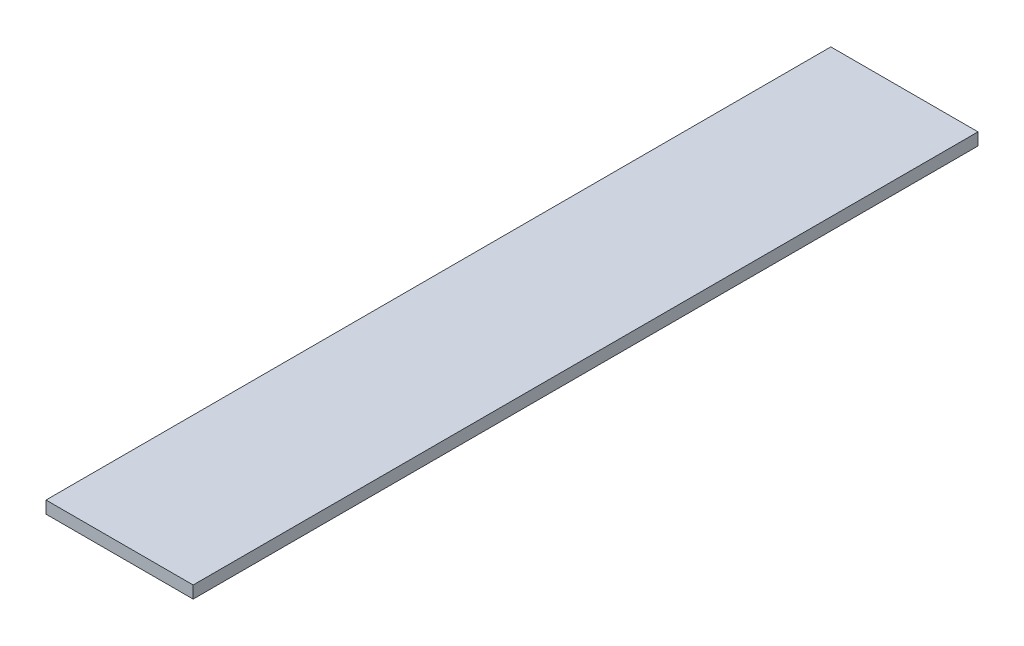
ISO-10303-21;
HEADER;
FILE_DESCRIPTION(('STEP AP214'),'2;1');
FILE_NAME('part.step','',(''),(''),'','','');
FILE_SCHEMA(('AUTOMOTIVE_DESIGN { 1 0 10303 214 1 1 1 1 }'));
ENDSEC;
DATA;
#1=APPLICATION_CONTEXT('core data for automotive mechanical design processes');
#2=APPLICATION_PROTOCOL_DEFINITION('international standard','automotive_design',2000,#1);
#3=PRODUCT_CONTEXT('',#1,'mechanical');
#4=PRODUCT('Part','Part','',(#3));
#5=PRODUCT_RELATED_PRODUCT_CATEGORY('part','',(#4));
#6=PRODUCT_DEFINITION_FORMATION('','',#4);
#7=PRODUCT_DEFINITION_CONTEXT('part definition',#1,'design');
#8=PRODUCT_DEFINITION('design','',#6,#7);
#9=PRODUCT_DEFINITION_SHAPE('','',#8);
#10=(LENGTH_UNIT() NAMED_UNIT(*) SI_UNIT(.MILLI.,.METRE.));
#11=(NAMED_UNIT(*) PLANE_ANGLE_UNIT() SI_UNIT($,.RADIAN.));
#12=(NAMED_UNIT(*) SI_UNIT($,.STERADIAN.) SOLID_ANGLE_UNIT());
#13=UNCERTAINTY_MEASURE_WITH_UNIT(LENGTH_MEASURE(1.E-05),#10,'distance_accuracy_value','');
#14=(GEOMETRIC_REPRESENTATION_CONTEXT(3) GLOBAL_UNCERTAINTY_ASSIGNED_CONTEXT((#13)) GLOBAL_UNIT_ASSIGNED_CONTEXT((#10,
#11,#12)) REPRESENTATION_CONTEXT('',''));
#15=CARTESIAN_POINT('',(0.,0.,0.));
#16=DIRECTION('',(0.,0.,1.));
#17=DIRECTION('',(1.,0.,0.));
#18=AXIS2_PLACEMENT_3D('',#15,#16,#17);
#19=CARTESIAN_POINT('',(9.525,-0.79375,101.6));
#20=DIRECTION('',(-1.,0.,0.));
#21=DIRECTION('',(0.,0.,1.));
#22=AXIS2_PLACEMENT_3D('',#19,#20,#21);
#23=PLANE('',#22);
#24=DIRECTION('',(0.,1.,0.));
#25=VECTOR('',#24,1.);
#26=CARTESIAN_POINT('',(9.525,-0.79375,0.));
#27=LINE('',#26,#25);
#28=CARTESIAN_POINT('',(9.525,-0.79375,0.));
#29=VERTEX_POINT('',#28);
#30=CARTESIAN_POINT('',(9.525,0.79375,0.));
#31=VERTEX_POINT('',#30);
#32=EDGE_CURVE('E107',#29,#31,#27,.T.);
#33=ORIENTED_EDGE('',*,*,#32,.T.);
#34=DIRECTION('',(0.,0.,-1.));
#35=VECTOR('',#34,1.);
#36=CARTESIAN_POINT('',(9.525,0.79375,101.6));
#37=LINE('',#36,#35);
#38=CARTESIAN_POINT('',(9.525,0.79375,101.6));
#39=VERTEX_POINT('',#38);
#40=EDGE_CURVE('E11',#39,#31,#37,.T.);
#41=ORIENTED_EDGE('',*,*,#40,.F.);
#42=DIRECTION('',(0.,1.,0.));
#43=VECTOR('',#42,1.);
#44=CARTESIAN_POINT('',(9.525,-0.79375,101.6));
#45=LINE('',#44,#43);
#46=CARTESIAN_POINT('',(9.525,-0.79375,101.6));
#47=VERTEX_POINT('',#46);
#48=EDGE_CURVE('E91',#47,#39,#45,.T.);
#49=ORIENTED_EDGE('',*,*,#48,.F.);
#50=DIRECTION('',(0.,0.,-1.));
#51=VECTOR('',#50,1.);
#52=CARTESIAN_POINT('',(9.525,-0.79375,101.6));
#53=LINE('',#52,#51);
#54=EDGE_CURVE('E103',#47,#29,#53,.T.);
#55=ORIENTED_EDGE('',*,*,#54,.T.);
#56=EDGE_LOOP('',(#33,#41,#49,#55));
#57=FACE_BOUND('',#56,.T.);
#58=ADVANCED_FACE('F39',(#57),#23,.F.);
#59=CARTESIAN_POINT('',(-9.525,0.79375,101.6));
#60=DIRECTION('',(0.,-1.,0.));
#61=DIRECTION('',(0.,0.,-1.));
#62=AXIS2_PLACEMENT_3D('',#59,#60,#61);
#63=PLANE('',#62);
#64=DIRECTION('',(-1.,0.,0.));
#65=VECTOR('',#64,1.);
#66=CARTESIAN_POINT('',(-9.525,0.79375,0.));
#67=LINE('',#66,#65);
#68=CARTESIAN_POINT('',(-9.525,0.79375,0.));
#69=VERTEX_POINT('',#68);
#70=EDGE_CURVE('E96',#31,#69,#67,.T.);
#71=ORIENTED_EDGE('',*,*,#70,.T.);
#72=DIRECTION('',(0.,0.,-1.));
#73=VECTOR('',#72,1.);
#74=CARTESIAN_POINT('',(-9.525,0.79375,101.6));
#75=LINE('',#74,#73);
#76=CARTESIAN_POINT('',(-9.525,0.79375,101.6));
#77=VERTEX_POINT('',#76);
#78=EDGE_CURVE('E48',#77,#69,#75,.T.);
#79=ORIENTED_EDGE('',*,*,#78,.F.);
#80=DIRECTION('',(-1.,0.,0.));
#81=VECTOR('',#80,1.);
#82=CARTESIAN_POINT('',(-9.525,0.79375,101.6));
#83=LINE('',#82,#81);
#84=EDGE_CURVE('E86',#39,#77,#83,.T.);
#85=ORIENTED_EDGE('',*,*,#84,.F.);
#86=ORIENTED_EDGE('',*,*,#40,.T.);
#87=EDGE_LOOP('',(#71,#79,#85,#86));
#88=FACE_BOUND('',#87,.T.);
#89=ADVANCED_FACE('F95',(#88),#63,.F.);
#90=CARTESIAN_POINT('',(-9.525,-0.79375,101.6));
#91=DIRECTION('',(1.,0.,0.));
#92=DIRECTION('',(0.,0.,-1.));
#93=AXIS2_PLACEMENT_3D('',#90,#91,#92);
#94=PLANE('',#93);
#95=DIRECTION('',(0.,-1.,0.));
#96=VECTOR('',#95,1.);
#97=CARTESIAN_POINT('',(-9.525,-0.79375,0.));
#98=LINE('',#97,#96);
#99=CARTESIAN_POINT('',(-9.525,-0.79375,0.));
#100=VERTEX_POINT('',#99);
#101=EDGE_CURVE('E73',#69,#100,#98,.T.);
#102=ORIENTED_EDGE('',*,*,#101,.T.);
#103=DIRECTION('',(0.,0.,-1.));
#104=VECTOR('',#103,1.);
#105=CARTESIAN_POINT('',(-9.525,-0.79375,101.6));
#106=LINE('',#105,#104);
#107=CARTESIAN_POINT('',(-9.525,-0.79375,101.6));
#108=VERTEX_POINT('',#107);
#109=EDGE_CURVE('E98',#108,#100,#106,.T.);
#110=ORIENTED_EDGE('',*,*,#109,.F.);
#111=DIRECTION('',(0.,-1.,0.));
#112=VECTOR('',#111,1.);
#113=CARTESIAN_POINT('',(-9.525,-0.79375,101.6));
#114=LINE('',#113,#112);
#115=EDGE_CURVE('E89',#77,#108,#114,.T.);
#116=ORIENTED_EDGE('',*,*,#115,.F.);
#117=ORIENTED_EDGE('',*,*,#78,.T.);
#118=EDGE_LOOP('',(#102,#110,#116,#117));
#119=FACE_BOUND('',#118,.T.);
#120=ADVANCED_FACE('F99',(#119),#94,.F.);
#121=CARTESIAN_POINT('',(-9.525,-0.79375,101.6));
#122=DIRECTION('',(0.,1.,0.));
#123=DIRECTION('',(0.,0.,1.));
#124=AXIS2_PLACEMENT_3D('',#121,#122,#123);
#125=PLANE('',#124);
#126=DIRECTION('',(1.,0.,0.));
#127=VECTOR('',#126,1.);
#128=CARTESIAN_POINT('',(-9.525,-0.79375,0.));
#129=LINE('',#128,#127);
#130=EDGE_CURVE('E79',#100,#29,#129,.T.);
#131=ORIENTED_EDGE('',*,*,#130,.T.);
#132=ORIENTED_EDGE('',*,*,#54,.F.);
#133=DIRECTION('',(1.,0.,0.));
#134=VECTOR('',#133,1.);
#135=CARTESIAN_POINT('',(-9.525,-0.79375,101.6));
#136=LINE('',#135,#134);
#137=EDGE_CURVE('E56',#108,#47,#136,.T.);
#138=ORIENTED_EDGE('',*,*,#137,.F.);
#139=ORIENTED_EDGE('',*,*,#109,.T.);
#140=EDGE_LOOP('',(#131,#132,#138,#139));
#141=FACE_BOUND('',#140,.T.);
#142=ADVANCED_FACE('F120',(#141),#125,.F.);
#143=CARTESIAN_POINT('',(0.,0.,101.6));
#144=DIRECTION('',(0.,0.,-1.));
#145=DIRECTION('',(-1.,0.,0.));
#146=AXIS2_PLACEMENT_3D('',#143,#144,#145);
#147=PLANE('',#146);
#148=ORIENTED_EDGE('',*,*,#48,.T.);
#149=ORIENTED_EDGE('',*,*,#84,.T.);
#150=ORIENTED_EDGE('',*,*,#115,.T.);
#151=ORIENTED_EDGE('',*,*,#137,.T.);
#152=EDGE_LOOP('',(#148,#149,#150,#151));
#153=FACE_BOUND('',#152,.T.);
#154=ADVANCED_FACE('F87',(#153),#147,.F.);
#155=CARTESIAN_POINT('',(0.,0.,0.));
#156=DIRECTION('',(0.,0.,-1.));
#157=DIRECTION('',(-1.,0.,0.));
#158=AXIS2_PLACEMENT_3D('',#155,#156,#157);
#159=PLANE('',#158);
#160=ORIENTED_EDGE('',*,*,#32,.F.);
#161=ORIENTED_EDGE('',*,*,#130,.F.);
#162=ORIENTED_EDGE('',*,*,#101,.F.);
#163=ORIENTED_EDGE('',*,*,#70,.F.);
#164=EDGE_LOOP('',(#160,#161,#162,#163));
#165=FACE_BOUND('',#164,.T.);
#166=ADVANCED_FACE('F123',(#165),#159,.T.);
#167=CLOSED_SHELL('',(#58,#89,#120,#142,#154,#166));
#168=MANIFOLD_SOLID_BREP('B2',#167);
#169=ADVANCED_BREP_SHAPE_REPRESENTATION('',(#18,#168),#14);
#170=SHAPE_DEFINITION_REPRESENTATION(#9,#169);
ENDSEC;
END-ISO-10303-21;
